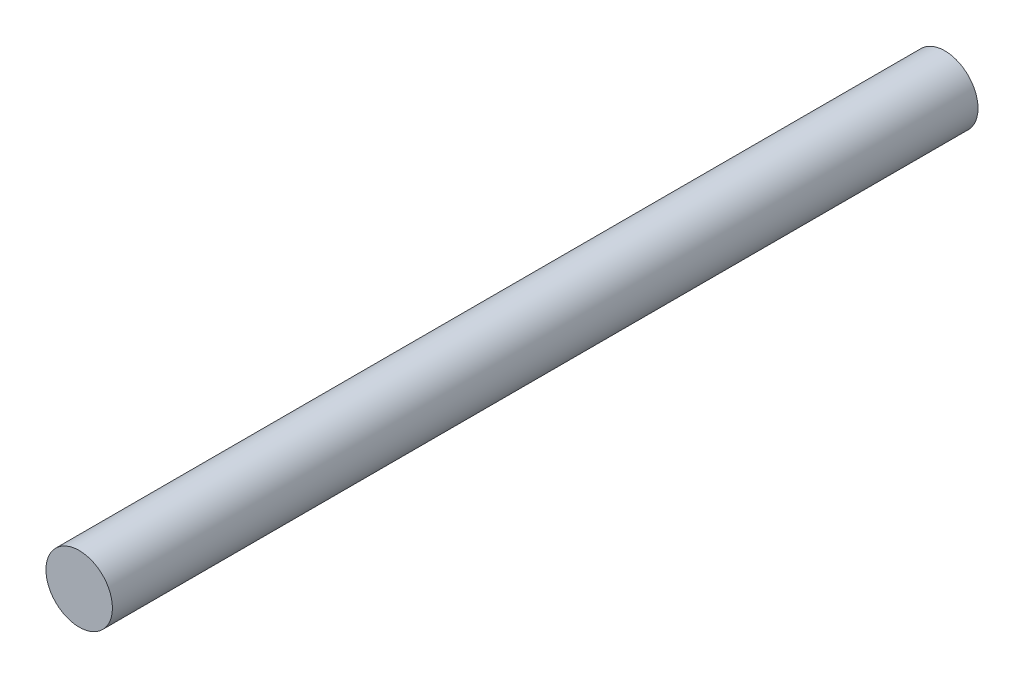
ISO-10303-21;
HEADER;
FILE_DESCRIPTION(('STEP AP214'),'2;1');
FILE_NAME('part.step','',(''),(''),'','','');
FILE_SCHEMA(('AUTOMOTIVE_DESIGN { 1 0 10303 214 1 1 1 1 }'));
ENDSEC;
DATA;
#1=APPLICATION_CONTEXT('core data for automotive mechanical design processes');
#2=APPLICATION_PROTOCOL_DEFINITION('international standard','automotive_design',2000,#1);
#3=PRODUCT_CONTEXT('',#1,'mechanical');
#4=PRODUCT('Part','Part','',(#3));
#5=PRODUCT_RELATED_PRODUCT_CATEGORY('part','',(#4));
#6=PRODUCT_DEFINITION_FORMATION('','',#4);
#7=PRODUCT_DEFINITION_CONTEXT('part definition',#1,'design');
#8=PRODUCT_DEFINITION('design','',#6,#7);
#9=PRODUCT_DEFINITION_SHAPE('','',#8);
#10=(LENGTH_UNIT() NAMED_UNIT(*) SI_UNIT(.MILLI.,.METRE.));
#11=(NAMED_UNIT(*) PLANE_ANGLE_UNIT() SI_UNIT($,.RADIAN.));
#12=(NAMED_UNIT(*) SI_UNIT($,.STERADIAN.) SOLID_ANGLE_UNIT());
#13=UNCERTAINTY_MEASURE_WITH_UNIT(LENGTH_MEASURE(1.E-05),#10,'distance_accuracy_value','');
#14=(GEOMETRIC_REPRESENTATION_CONTEXT(3) GLOBAL_UNCERTAINTY_ASSIGNED_CONTEXT((#13)) GLOBAL_UNIT_ASSIGNED_CONTEXT((#10,
#11,#12)) REPRESENTATION_CONTEXT('',''));
#15=CARTESIAN_POINT('',(0.,0.,0.));
#16=DIRECTION('',(0.,0.,1.));
#17=DIRECTION('',(1.,0.,0.));
#18=AXIS2_PLACEMENT_3D('',#15,#16,#17);
#19=CARTESIAN_POINT('',(0.,0.,-82.677));
#20=DIRECTION('',(0.,0.,1.));
#21=DIRECTION('',(1.,0.,0.));
#22=AXIS2_PLACEMENT_3D('',#19,#20,#21);
#23=CYLINDRICAL_SURFACE('',#22,3.175);
#24=CARTESIAN_POINT('',(0.,0.,-82.677));
#25=DIRECTION('',(0.,0.,1.));
#26=DIRECTION('',(1.,0.,0.));
#27=AXIS2_PLACEMENT_3D('',#24,#25,#26);
#28=CIRCLE('',#27,3.175);
#29=CARTESIAN_POINT('',(3.175,0.,-82.677));
#30=VERTEX_POINT('',#29);
#31=EDGE_CURVE('E10',#30,#30,#28,.T.);
#32=ORIENTED_EDGE('',*,*,#31,.T.);
#33=EDGE_LOOP('',(#32));
#34=FACE_BOUND('',#33,.T.);
#35=CARTESIAN_POINT('',(0.,0.,0.));
#36=DIRECTION('',(0.,0.,1.));
#37=DIRECTION('',(1.,0.,0.));
#38=AXIS2_PLACEMENT_3D('',#35,#36,#37);
#39=CIRCLE('',#38,3.175);
#40=CARTESIAN_POINT('',(3.175,0.,0.));
#41=VERTEX_POINT('',#40);
#42=EDGE_CURVE('E36',#41,#41,#39,.T.);
#43=ORIENTED_EDGE('',*,*,#42,.F.);
#44=EDGE_LOOP('',(#43));
#45=FACE_BOUND('',#44,.T.);
#46=ADVANCED_FACE('F33',(#34,#45),#23,.T.);
#47=CARTESIAN_POINT('',(0.,0.,-82.677));
#48=DIRECTION('',(0.,0.,1.));
#49=DIRECTION('',(1.,0.,0.));
#50=AXIS2_PLACEMENT_3D('',#47,#48,#49);
#51=PLANE('',#50);
#52=ORIENTED_EDGE('',*,*,#31,.F.);
#53=EDGE_LOOP('',(#52));
#54=FACE_BOUND('',#53,.T.);
#55=ADVANCED_FACE('F48',(#54),#51,.F.);
#56=CARTESIAN_POINT('',(0.,0.,0.));
#57=DIRECTION('',(0.,0.,1.));
#58=DIRECTION('',(1.,0.,0.));
#59=AXIS2_PLACEMENT_3D('',#56,#57,#58);
#60=PLANE('',#59);
#61=ORIENTED_EDGE('',*,*,#42,.T.);
#62=EDGE_LOOP('',(#61));
#63=FACE_BOUND('',#62,.T.);
#64=ADVANCED_FACE('F45',(#63),#60,.T.);
#65=CLOSED_SHELL('',(#46,#55,#64));
#66=MANIFOLD_SOLID_BREP('B2',#65);
#67=ADVANCED_BREP_SHAPE_REPRESENTATION('',(#18,#66),#14);
#68=SHAPE_DEFINITION_REPRESENTATION(#9,#67);
ENDSEC;
END-ISO-10303-21;
